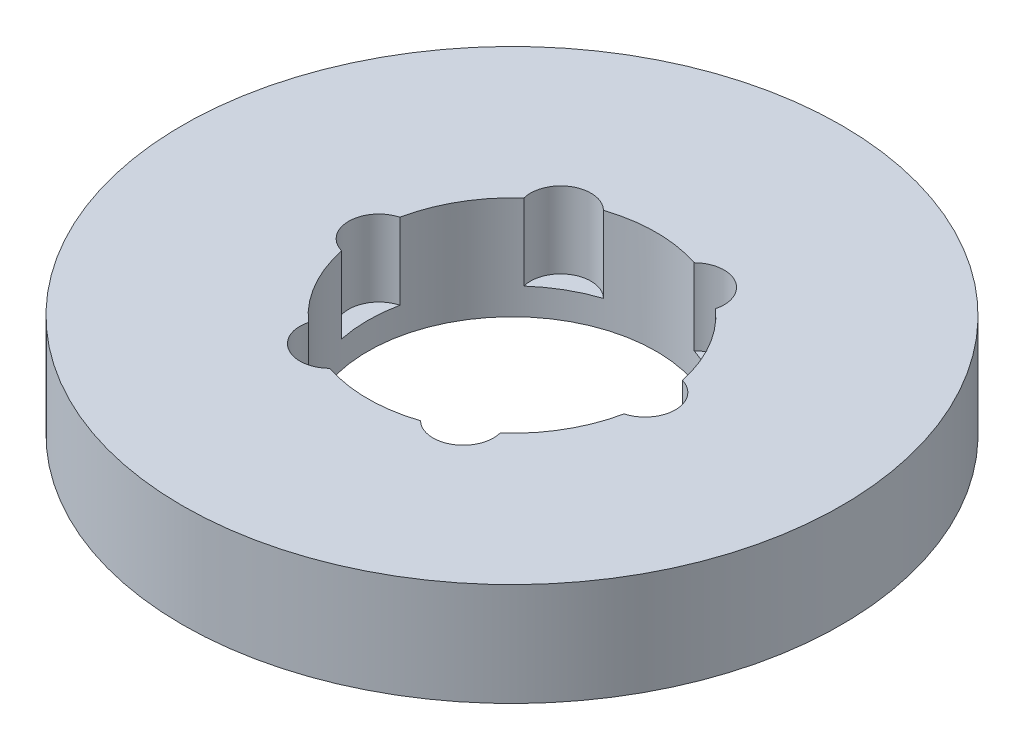
ISO-10303-21;
HEADER;
FILE_DESCRIPTION(('STEP AP214'),'2;1');
FILE_NAME('part.step','',(''),(''),'','','');
FILE_SCHEMA(('AUTOMOTIVE_DESIGN { 1 0 10303 214 1 1 1 1 }'));
ENDSEC;
DATA;
#1=APPLICATION_CONTEXT('core data for automotive mechanical design processes');
#2=APPLICATION_PROTOCOL_DEFINITION('international standard','automotive_design',2000,#1);
#3=PRODUCT_CONTEXT('',#1,'mechanical');
#4=PRODUCT('Part','Part','',(#3));
#5=PRODUCT_RELATED_PRODUCT_CATEGORY('part','',(#4));
#6=PRODUCT_DEFINITION_FORMATION('','',#4);
#7=PRODUCT_DEFINITION_CONTEXT('part definition',#1,'design');
#8=PRODUCT_DEFINITION('design','',#6,#7);
#9=PRODUCT_DEFINITION_SHAPE('','',#8);
#10=(LENGTH_UNIT() NAMED_UNIT(*) SI_UNIT(.MILLI.,.METRE.));
#11=(NAMED_UNIT(*) PLANE_ANGLE_UNIT() SI_UNIT($,.RADIAN.));
#12=(NAMED_UNIT(*) SI_UNIT($,.STERADIAN.) SOLID_ANGLE_UNIT());
#13=UNCERTAINTY_MEASURE_WITH_UNIT(LENGTH_MEASURE(1.E-05),#10,'distance_accuracy_value','');
#14=(GEOMETRIC_REPRESENTATION_CONTEXT(3) GLOBAL_UNCERTAINTY_ASSIGNED_CONTEXT((#13)) GLOBAL_UNIT_ASSIGNED_CONTEXT((#10,
#11,#12)) REPRESENTATION_CONTEXT('',''));
#15=CARTESIAN_POINT('',(0.,0.,0.));
#16=DIRECTION('',(0.,0.,1.));
#17=DIRECTION('',(1.,0.,0.));
#18=AXIS2_PLACEMENT_3D('',#15,#16,#17);
#19=CARTESIAN_POINT('',(0.,25.,0.));
#20=DIRECTION('',(0.,-1.,0.));
#21=DIRECTION('',(0.,0.,-1.));
#22=AXIS2_PLACEMENT_3D('',#19,#20,#21);
#23=CYLINDRICAL_SURFACE('',#22,80.);
#24=CARTESIAN_POINT('',(0.,25.,0.));
#25=DIRECTION('',(0.,1.,0.));
#26=DIRECTION('',(0.,0.,1.));
#27=AXIS2_PLACEMENT_3D('',#24,#25,#26);
#28=CIRCLE('',#27,80.);
#29=CARTESIAN_POINT('',(0.,25.,80.));
#30=VERTEX_POINT('',#29);
#31=EDGE_CURVE('E162',#30,#30,#28,.T.);
#32=ORIENTED_EDGE('',*,*,#31,.F.);
#33=EDGE_LOOP('',(#32));
#34=FACE_BOUND('',#33,.T.);
#35=CARTESIAN_POINT('',(0.,0.,0.));
#36=DIRECTION('',(0.,1.,0.));
#37=DIRECTION('',(0.,0.,1.));
#38=AXIS2_PLACEMENT_3D('',#35,#36,#37);
#39=CIRCLE('',#38,80.);
#40=CARTESIAN_POINT('',(0.,0.,80.));
#41=VERTEX_POINT('',#40);
#42=EDGE_CURVE('E157',#41,#41,#39,.T.);
#43=ORIENTED_EDGE('',*,*,#42,.T.);
#44=EDGE_LOOP('',(#43));
#45=FACE_BOUND('',#44,.T.);
#46=ADVANCED_FACE('F39',(#34,#45),#23,.T.);
#47=CARTESIAN_POINT('',(0.,25.,0.));
#48=DIRECTION('',(0.,1.,0.));
#49=DIRECTION('',(0.,0.,1.));
#50=AXIS2_PLACEMENT_3D('',#47,#48,#49);
#51=PLANE('',#50);
#52=CARTESIAN_POINT('',(-16.156920130633,25.,-27.984606560088));
#53=DIRECTION('',(0.,1.,0.));
#54=DIRECTION('',(-0.866025403784433,0.,0.50000000000001));
#55=AXIS2_PLACEMENT_3D('',#52,#53,#54);
#56=CIRCLE('',#55,7.34113736817755);
#57=CARTESIAN_POINT('',(-11.0129916092175,25.,-33.2221916166785));
#58=VERTEX_POINT('',#57);
#59=CARTESIAN_POINT('',(-23.2647661048299,25.,-26.1486263135859));
#60=VERTEX_POINT('',#59);
#61=EDGE_CURVE('E218',#58,#60,#56,.T.);
#62=ORIENTED_EDGE('',*,*,#61,.F.);
#63=CARTESIAN_POINT('',(0.,25.,0.));
#64=DIRECTION('',(0.,1.,0.));
#65=DIRECTION('',(0.,0.,1.));
#66=AXIS2_PLACEMENT_3D('',#63,#64,#65);
#67=CIRCLE('',#66,35.);
#68=CARTESIAN_POINT('',(11.0129916092168,25.,-33.2221916166788));
#69=VERTEX_POINT('',#68);
#70=EDGE_CURVE('E169',#69,#58,#67,.T.);
#71=ORIENTED_EDGE('',*,*,#70,.F.);
#72=CARTESIAN_POINT('',(16.1569201306324,25.,-27.9846065600884));
#73=DIRECTION('',(0.,1.,0.));
#74=DIRECTION('',(-0.866025403784443,0.,-0.499999999999992));
#75=AXIS2_PLACEMENT_3D('',#72,#73,#74);
#76=CIRCLE('',#75,7.34113736817755);
#77=CARTESIAN_POINT('',(23.2647661048294,25.,-26.1486263135864));
#78=VERTEX_POINT('',#77);
#79=EDGE_CURVE('E285',#78,#69,#76,.T.);
#80=ORIENTED_EDGE('',*,*,#79,.F.);
#81=CARTESIAN_POINT('',(34.2777577140467,25.,-7.07356530309248));
#82=VERTEX_POINT('',#81);
#83=EDGE_CURVE('E174',#82,#78,#67,.T.);
#84=ORIENTED_EDGE('',*,*,#83,.F.);
#85=CARTESIAN_POINT('',(32.3138402612654,25.,0.));
#86=DIRECTION('',(0.,1.,0.));
#87=DIRECTION('',(0.,0.,-1.));
#88=AXIS2_PLACEMENT_3D('',#85,#86,#87);
#89=CIRCLE('',#88,7.34113736817755);
#90=CARTESIAN_POINT('',(34.2777577140467,25.,7.07356530309248));
#91=VERTEX_POINT('',#90);
#92=EDGE_CURVE('E280',#91,#82,#89,.T.);
#93=ORIENTED_EDGE('',*,*,#92,.F.);
#94=CARTESIAN_POINT('',(23.2647661048297,25.,26.1486263135861));
#95=VERTEX_POINT('',#94);
#96=EDGE_CURVE('E164',#95,#91,#67,.T.);
#97=ORIENTED_EDGE('',*,*,#96,.F.);
#98=CARTESIAN_POINT('',(16.1569201306328,25.,27.9846065600881));
#99=DIRECTION('',(0.,1.,0.));
#100=DIRECTION('',(0.866025403784436,0.,-0.500000000000004));
#101=AXIS2_PLACEMENT_3D('',#98,#99,#100);
#102=CIRCLE('',#101,7.34113736817755);
#103=CARTESIAN_POINT('',(11.0129916092172,25.,33.2221916166786));
#104=VERTEX_POINT('',#103);
#105=EDGE_CURVE('E269',#104,#95,#102,.T.);
#106=ORIENTED_EDGE('',*,*,#105,.F.);
#107=CARTESIAN_POINT('',(-11.012991609217,25.,33.2221916166787));
#108=VERTEX_POINT('',#107);
#109=EDGE_CURVE('E149',#108,#104,#67,.T.);
#110=ORIENTED_EDGE('',*,*,#109,.F.);
#111=CARTESIAN_POINT('',(-16.1569201306326,25.,27.9846065600883));
#112=DIRECTION('',(0.,1.,0.));
#113=DIRECTION('',(0.86602540378444,0.,0.499999999999998));
#114=AXIS2_PLACEMENT_3D('',#111,#112,#113);
#115=CIRCLE('',#114,7.34113736817755);
#116=CARTESIAN_POINT('',(-23.2647661048295,25.,26.1486263135863));
#117=VERTEX_POINT('',#116);
#118=EDGE_CURVE('E128',#117,#108,#115,.T.);
#119=ORIENTED_EDGE('',*,*,#118,.F.);
#120=CARTESIAN_POINT('',(-34.2777577140467,25.,7.07356530309248));
#121=VERTEX_POINT('',#120);
#122=EDGE_CURVE('E148',#121,#117,#67,.T.);
#123=ORIENTED_EDGE('',*,*,#122,.F.);
#124=CARTESIAN_POINT('',(-32.3138402612654,25.,0.));
#125=DIRECTION('',(0.,1.,0.));
#126=DIRECTION('',(0.,0.,1.));
#127=AXIS2_PLACEMENT_3D('',#124,#125,#126);
#128=CIRCLE('',#127,7.34113736817755);
#129=CARTESIAN_POINT('',(-34.2777577140467,25.,-7.07356530309248));
#130=VERTEX_POINT('',#129);
#131=EDGE_CURVE('E179',#130,#121,#128,.T.);
#132=ORIENTED_EDGE('',*,*,#131,.F.);
#133=EDGE_CURVE('E161',#60,#130,#67,.T.);
#134=ORIENTED_EDGE('',*,*,#133,.F.);
#135=EDGE_LOOP('',(#62,#71,#80,#84,#93,#97,#106,#110,#119,#123,#132,#134));
#136=FACE_BOUND('',#135,.T.);
#137=ORIENTED_EDGE('',*,*,#31,.T.);
#138=EDGE_LOOP('',(#137));
#139=FACE_BOUND('',#138,.T.);
#140=ADVANCED_FACE('F141',(#136,#139),#51,.T.);
#141=CARTESIAN_POINT('',(0.,0.,0.));
#142=DIRECTION('',(0.,1.,0.));
#143=DIRECTION('',(0.,0.,1.));
#144=AXIS2_PLACEMENT_3D('',#141,#142,#143);
#145=PLANE('',#144);
#146=CARTESIAN_POINT('',(0.,0.,0.));
#147=DIRECTION('',(0.,1.,0.));
#148=DIRECTION('',(0.,0.,1.));
#149=AXIS2_PLACEMENT_3D('',#146,#147,#148);
#150=CIRCLE('',#149,35.);
#151=CARTESIAN_POINT('',(0.,0.,35.));
#152=VERTEX_POINT('',#151);
#153=EDGE_CURVE('E166',#152,#152,#150,.T.);
#154=ORIENTED_EDGE('',*,*,#153,.T.);
#155=EDGE_LOOP('',(#154));
#156=FACE_BOUND('',#155,.T.);
#157=ORIENTED_EDGE('',*,*,#42,.F.);
#158=EDGE_LOOP('',(#157));
#159=FACE_BOUND('',#158,.T.);
#160=ADVANCED_FACE('F234',(#156,#159),#145,.F.);
#161=CARTESIAN_POINT('',(0.,25.,0.));
#162=DIRECTION('',(0.,-1.,0.));
#163=DIRECTION('',(0.,0.,-1.));
#164=AXIS2_PLACEMENT_3D('',#161,#162,#163);
#165=CYLINDRICAL_SURFACE('',#164,35.);
#166=DIRECTION('',(0.,1.,0.));
#167=VECTOR('',#166,1.);
#168=CARTESIAN_POINT('',(-11.0129916092175,15.7467491330755,-33.2221916166786));
#169=LINE('',#168,#167);
#170=CARTESIAN_POINT('',(-11.0129916092175,6.49349826615095,-33.2221916166785));
#171=VERTEX_POINT('',#170);
#172=EDGE_CURVE('E11',#171,#58,#169,.T.);
#173=ORIENTED_EDGE('',*,*,#172,.F.);
#174=CARTESIAN_POINT('',(0.,6.49349826615095,0.));
#175=DIRECTION('',(0.,1.,0.));
#176=DIRECTION('',(0.,0.,1.));
#177=AXIS2_PLACEMENT_3D('',#174,#175,#176);
#178=CIRCLE('',#177,35.);
#179=CARTESIAN_POINT('',(-23.2647661048299,6.49349826615095,-26.1486263135859));
#180=VERTEX_POINT('',#179);
#181=EDGE_CURVE('E214',#171,#180,#178,.T.);
#182=ORIENTED_EDGE('',*,*,#181,.T.);
#183=DIRECTION('',(0.,1.,0.));
#184=VECTOR('',#183,1.);
#185=CARTESIAN_POINT('',(-23.2647661048299,15.7467491330755,-26.1486263135859));
#186=LINE('',#185,#184);
#187=EDGE_CURVE('E46',#60,#180,#186,.F.);
#188=ORIENTED_EDGE('',*,*,#187,.F.);
#189=ORIENTED_EDGE('',*,*,#133,.T.);
#190=DIRECTION('',(0.,1.,0.));
#191=VECTOR('',#190,1.);
#192=CARTESIAN_POINT('',(-34.2777577140467,15.7467491330755,-7.07356530309247));
#193=LINE('',#192,#191);
#194=CARTESIAN_POINT('',(-34.2777577140467,6.49349826615095,-7.07356530309248));
#195=VERTEX_POINT('',#194);
#196=EDGE_CURVE('E187',#195,#130,#193,.T.);
#197=ORIENTED_EDGE('',*,*,#196,.F.);
#198=CARTESIAN_POINT('',(0.,6.49349826615095,0.));
#199=DIRECTION('',(0.,1.,0.));
#200=DIRECTION('',(0.,0.,1.));
#201=AXIS2_PLACEMENT_3D('',#198,#199,#200);
#202=CIRCLE('',#201,35.);
#203=CARTESIAN_POINT('',(-34.2777577140467,6.49349826615095,7.07356530309248));
#204=VERTEX_POINT('',#203);
#205=EDGE_CURVE('E184',#195,#204,#202,.T.);
#206=ORIENTED_EDGE('',*,*,#205,.T.);
#207=DIRECTION('',(0.,1.,0.));
#208=VECTOR('',#207,1.);
#209=CARTESIAN_POINT('',(-34.2777577140467,15.7467491330755,7.07356530309247));
#210=LINE('',#209,#208);
#211=EDGE_CURVE('E158',#121,#204,#210,.F.);
#212=ORIENTED_EDGE('',*,*,#211,.F.);
#213=ORIENTED_EDGE('',*,*,#122,.T.);
#214=DIRECTION('',(0.,1.,0.));
#215=VECTOR('',#214,1.);
#216=CARTESIAN_POINT('',(-23.2647661048295,15.7467491330755,26.1486263135863));
#217=LINE('',#216,#215);
#218=CARTESIAN_POINT('',(-23.2647661048295,6.49349826615095,26.1486263135863));
#219=VERTEX_POINT('',#218);
#220=EDGE_CURVE('E127',#219,#117,#217,.T.);
#221=ORIENTED_EDGE('',*,*,#220,.F.);
#222=CARTESIAN_POINT('',(0.,6.49349826615095,0.));
#223=DIRECTION('',(0.,1.,0.));
#224=DIRECTION('',(0.,0.,1.));
#225=AXIS2_PLACEMENT_3D('',#222,#223,#224);
#226=CIRCLE('',#225,35.);
#227=CARTESIAN_POINT('',(-11.012991609217,6.49349826615095,33.2221916166787));
#228=VERTEX_POINT('',#227);
#229=EDGE_CURVE('E189',#219,#228,#226,.T.);
#230=ORIENTED_EDGE('',*,*,#229,.T.);
#231=DIRECTION('',(0.,1.,0.));
#232=VECTOR('',#231,1.);
#233=CARTESIAN_POINT('',(-11.012991609217,15.7467491330755,33.2221916166787));
#234=LINE('',#233,#232);
#235=EDGE_CURVE('E140',#108,#228,#234,.F.);
#236=ORIENTED_EDGE('',*,*,#235,.F.);
#237=ORIENTED_EDGE('',*,*,#109,.T.);
#238=DIRECTION('',(0.,1.,0.));
#239=VECTOR('',#238,1.);
#240=CARTESIAN_POINT('',(11.0129916092172,15.7467491330755,33.2221916166786));
#241=LINE('',#240,#239);
#242=CARTESIAN_POINT('',(11.0129916092172,6.49349826615095,33.2221916166786));
#243=VERTEX_POINT('',#242);
#244=EDGE_CURVE('E196',#243,#104,#241,.T.);
#245=ORIENTED_EDGE('',*,*,#244,.F.);
#246=CARTESIAN_POINT('',(0.,6.49349826615095,0.));
#247=DIRECTION('',(0.,1.,0.));
#248=DIRECTION('',(0.,0.,1.));
#249=AXIS2_PLACEMENT_3D('',#246,#247,#248);
#250=CIRCLE('',#249,35.);
#251=CARTESIAN_POINT('',(23.2647661048297,6.49349826615095,26.1486263135861));
#252=VERTEX_POINT('',#251);
#253=EDGE_CURVE('E136',#243,#252,#250,.T.);
#254=ORIENTED_EDGE('',*,*,#253,.T.);
#255=DIRECTION('',(0.,1.,0.));
#256=VECTOR('',#255,1.);
#257=CARTESIAN_POINT('',(23.2647661048297,15.7467491330755,26.1486263135861));
#258=LINE('',#257,#256);
#259=EDGE_CURVE('E194',#95,#252,#258,.F.);
#260=ORIENTED_EDGE('',*,*,#259,.F.);
#261=ORIENTED_EDGE('',*,*,#96,.T.);
#262=DIRECTION('',(0.,1.,0.));
#263=VECTOR('',#262,1.);
#264=CARTESIAN_POINT('',(34.2777577140467,15.7467491330755,7.07356530309247));
#265=LINE('',#264,#263);
#266=CARTESIAN_POINT('',(34.2777577140467,6.49349826615095,7.07356530309248));
#267=VERTEX_POINT('',#266);
#268=EDGE_CURVE('E206',#267,#91,#265,.T.);
#269=ORIENTED_EDGE('',*,*,#268,.F.);
#270=CARTESIAN_POINT('',(0.,6.49349826615095,0.));
#271=DIRECTION('',(0.,1.,0.));
#272=DIRECTION('',(0.,0.,1.));
#273=AXIS2_PLACEMENT_3D('',#270,#271,#272);
#274=CIRCLE('',#273,35.);
#275=CARTESIAN_POINT('',(34.2777577140467,6.49349826615095,-7.07356530309248));
#276=VERTEX_POINT('',#275);
#277=EDGE_CURVE('E199',#267,#276,#274,.T.);
#278=ORIENTED_EDGE('',*,*,#277,.T.);
#279=DIRECTION('',(0.,1.,0.));
#280=VECTOR('',#279,1.);
#281=CARTESIAN_POINT('',(34.2777577140467,15.7467491330755,-7.07356530309247));
#282=LINE('',#281,#280);
#283=EDGE_CURVE('E201',#82,#276,#282,.F.);
#284=ORIENTED_EDGE('',*,*,#283,.F.);
#285=ORIENTED_EDGE('',*,*,#83,.T.);
#286=DIRECTION('',(0.,1.,0.));
#287=VECTOR('',#286,1.);
#288=CARTESIAN_POINT('',(23.2647661048294,15.7467491330755,-26.1486263135864));
#289=LINE('',#288,#287);
#290=CARTESIAN_POINT('',(23.2647661048294,6.49349826615095,-26.1486263135864));
#291=VERTEX_POINT('',#290);
#292=EDGE_CURVE('E213',#291,#78,#289,.T.);
#293=ORIENTED_EDGE('',*,*,#292,.F.);
#294=CARTESIAN_POINT('',(0.,6.49349826615095,0.));
#295=DIRECTION('',(0.,1.,0.));
#296=DIRECTION('',(0.,0.,1.));
#297=AXIS2_PLACEMENT_3D('',#294,#295,#296);
#298=CIRCLE('',#297,35.);
#299=CARTESIAN_POINT('',(11.0129916092168,6.49349826615095,-33.2221916166788));
#300=VERTEX_POINT('',#299);
#301=EDGE_CURVE('E208',#291,#300,#298,.T.);
#302=ORIENTED_EDGE('',*,*,#301,.T.);
#303=DIRECTION('',(0.,1.,0.));
#304=VECTOR('',#303,1.);
#305=CARTESIAN_POINT('',(11.0129916092168,15.7467491330755,-33.2221916166788));
#306=LINE('',#305,#304);
#307=EDGE_CURVE('E211',#69,#300,#306,.F.);
#308=ORIENTED_EDGE('',*,*,#307,.F.);
#309=ORIENTED_EDGE('',*,*,#70,.T.);
#310=EDGE_LOOP('',(#173,#182,#188,#189,#197,#206,#212,#213,#221,#230,#236,#237,#245,#254,#260,
#261,#269,#278,#284,#285,#293,#302,#308,#309));
#311=FACE_BOUND('',#310,.T.);
#312=ORIENTED_EDGE('',*,*,#153,.F.);
#313=EDGE_LOOP('',(#312));
#314=FACE_BOUND('',#313,.T.);
#315=ADVANCED_FACE('F152',(#311,#314),#165,.F.);
#316=CARTESIAN_POINT('',(-32.3138402612654,6.49349826615095,0.));
#317=DIRECTION('',(0.,1.,0.));
#318=DIRECTION('',(0.,0.,1.));
#319=AXIS2_PLACEMENT_3D('',#316,#317,#318);
#320=CYLINDRICAL_SURFACE('',#319,7.34113736817755);
#321=ORIENTED_EDGE('',*,*,#196,.T.);
#322=ORIENTED_EDGE('',*,*,#131,.T.);
#323=ORIENTED_EDGE('',*,*,#211,.T.);
#324=CARTESIAN_POINT('',(-32.3138402612654,6.49349826615095,0.));
#325=DIRECTION('',(0.,1.,0.));
#326=DIRECTION('',(0.,0.,1.));
#327=AXIS2_PLACEMENT_3D('',#324,#325,#326);
#328=CIRCLE('',#327,7.34113736817755);
#329=EDGE_CURVE('E180',#195,#204,#328,.T.);
#330=ORIENTED_EDGE('',*,*,#329,.F.);
#331=EDGE_LOOP('',(#321,#322,#323,#330));
#332=FACE_BOUND('',#331,.T.);
#333=ADVANCED_FACE('F244',(#332),#320,.F.);
#334=CARTESIAN_POINT('',(-32.3138402612654,6.49349826615095,0.));
#335=DIRECTION('',(0.,1.,0.));
#336=DIRECTION('',(0.,0.,1.));
#337=AXIS2_PLACEMENT_3D('',#334,#335,#336);
#338=PLANE('',#337);
#339=ORIENTED_EDGE('',*,*,#329,.T.);
#340=ORIENTED_EDGE('',*,*,#205,.F.);
#341=EDGE_LOOP('',(#339,#340));
#342=FACE_BOUND('',#341,.T.);
#343=ADVANCED_FACE('F248',(#342),#338,.T.);
#344=CARTESIAN_POINT('',(-16.1569201306326,6.49349826615095,27.9846065600883));
#345=DIRECTION('',(0.,1.,0.));
#346=DIRECTION('',(0.,0.,1.));
#347=AXIS2_PLACEMENT_3D('',#344,#345,#346);
#348=CYLINDRICAL_SURFACE('',#347,7.34113736817755);
#349=ORIENTED_EDGE('',*,*,#220,.T.);
#350=ORIENTED_EDGE('',*,*,#118,.T.);
#351=ORIENTED_EDGE('',*,*,#235,.T.);
#352=CARTESIAN_POINT('',(-16.1569201306326,6.49349826615095,27.9846065600883));
#353=DIRECTION('',(0.,1.,0.));
#354=DIRECTION('',(0.86602540378444,0.,0.499999999999998));
#355=AXIS2_PLACEMENT_3D('',#352,#353,#354);
#356=CIRCLE('',#355,7.34113736817755);
#357=EDGE_CURVE('E135',#219,#228,#356,.T.);
#358=ORIENTED_EDGE('',*,*,#357,.F.);
#359=EDGE_LOOP('',(#349,#350,#351,#358));
#360=FACE_BOUND('',#359,.T.);
#361=ADVANCED_FACE('F126',(#360),#348,.F.);
#362=CARTESIAN_POINT('',(-16.1569201306326,6.49349826615095,27.9846065600883));
#363=DIRECTION('',(0.,1.,0.));
#364=DIRECTION('',(0.86602540378444,0.,0.499999999999998));
#365=AXIS2_PLACEMENT_3D('',#362,#363,#364);
#366=PLANE('',#365);
#367=ORIENTED_EDGE('',*,*,#357,.T.);
#368=ORIENTED_EDGE('',*,*,#229,.F.);
#369=EDGE_LOOP('',(#367,#368));
#370=FACE_BOUND('',#369,.T.);
#371=ADVANCED_FACE('F258',(#370),#366,.T.);
#372=CARTESIAN_POINT('',(16.1569201306328,6.49349826615095,27.9846065600881));
#373=DIRECTION('',(0.,1.,0.));
#374=DIRECTION('',(0.,0.,1.));
#375=AXIS2_PLACEMENT_3D('',#372,#373,#374);
#376=CYLINDRICAL_SURFACE('',#375,7.34113736817755);
#377=ORIENTED_EDGE('',*,*,#244,.T.);
#378=ORIENTED_EDGE('',*,*,#105,.T.);
#379=ORIENTED_EDGE('',*,*,#259,.T.);
#380=CARTESIAN_POINT('',(16.1569201306328,6.49349826615095,27.9846065600881));
#381=DIRECTION('',(0.,1.,0.));
#382=DIRECTION('',(0.866025403784436,0.,-0.500000000000004));
#383=AXIS2_PLACEMENT_3D('',#380,#381,#382);
#384=CIRCLE('',#383,7.34113736817755);
#385=EDGE_CURVE('E147',#243,#252,#384,.T.);
#386=ORIENTED_EDGE('',*,*,#385,.F.);
#387=EDGE_LOOP('',(#377,#378,#379,#386));
#388=FACE_BOUND('',#387,.T.);
#389=ADVANCED_FACE('F256',(#388),#376,.F.);
#390=CARTESIAN_POINT('',(16.1569201306328,6.49349826615095,27.9846065600881));
#391=DIRECTION('',(0.,1.,0.));
#392=DIRECTION('',(0.866025403784436,0.,-0.500000000000004));
#393=AXIS2_PLACEMENT_3D('',#390,#391,#392);
#394=PLANE('',#393);
#395=ORIENTED_EDGE('',*,*,#385,.T.);
#396=ORIENTED_EDGE('',*,*,#253,.F.);
#397=EDGE_LOOP('',(#395,#396));
#398=FACE_BOUND('',#397,.T.);
#399=ADVANCED_FACE('F263',(#398),#394,.T.);
#400=CARTESIAN_POINT('',(32.3138402612654,6.49349826615095,0.));
#401=DIRECTION('',(0.,1.,0.));
#402=DIRECTION('',(0.,0.,1.));
#403=AXIS2_PLACEMENT_3D('',#400,#401,#402);
#404=CYLINDRICAL_SURFACE('',#403,7.34113736817755);
#405=ORIENTED_EDGE('',*,*,#268,.T.);
#406=ORIENTED_EDGE('',*,*,#92,.T.);
#407=ORIENTED_EDGE('',*,*,#283,.T.);
#408=CARTESIAN_POINT('',(32.3138402612654,6.49349826615095,0.));
#409=DIRECTION('',(0.,1.,0.));
#410=DIRECTION('',(0.,0.,-1.));
#411=AXIS2_PLACEMENT_3D('',#408,#409,#410);
#412=CIRCLE('',#411,7.34113736817755);
#413=EDGE_CURVE('E273',#267,#276,#412,.T.);
#414=ORIENTED_EDGE('',*,*,#413,.F.);
#415=EDGE_LOOP('',(#405,#406,#407,#414));
#416=FACE_BOUND('',#415,.T.);
#417=ADVANCED_FACE('F297',(#416),#404,.F.);
#418=CARTESIAN_POINT('',(32.3138402612654,6.49349826615095,0.));
#419=DIRECTION('',(0.,1.,0.));
#420=DIRECTION('',(0.,0.,-1.));
#421=AXIS2_PLACEMENT_3D('',#418,#419,#420);
#422=PLANE('',#421);
#423=ORIENTED_EDGE('',*,*,#413,.T.);
#424=ORIENTED_EDGE('',*,*,#277,.F.);
#425=EDGE_LOOP('',(#423,#424));
#426=FACE_BOUND('',#425,.T.);
#427=ADVANCED_FACE('F299',(#426),#422,.T.);
#428=CARTESIAN_POINT('',(16.1569201306324,6.49349826615095,-27.9846065600884));
#429=DIRECTION('',(0.,1.,0.));
#430=DIRECTION('',(0.,0.,1.));
#431=AXIS2_PLACEMENT_3D('',#428,#429,#430);
#432=CYLINDRICAL_SURFACE('',#431,7.34113736817755);
#433=ORIENTED_EDGE('',*,*,#292,.T.);
#434=ORIENTED_EDGE('',*,*,#79,.T.);
#435=ORIENTED_EDGE('',*,*,#307,.T.);
#436=CARTESIAN_POINT('',(16.1569201306324,6.49349826615095,-27.9846065600884));
#437=DIRECTION('',(0.,1.,0.));
#438=DIRECTION('',(-0.866025403784443,0.,-0.499999999999992));
#439=AXIS2_PLACEMENT_3D('',#436,#437,#438);
#440=CIRCLE('',#439,7.34113736817755);
#441=EDGE_CURVE('E56',#291,#300,#440,.T.);
#442=ORIENTED_EDGE('',*,*,#441,.F.);
#443=EDGE_LOOP('',(#433,#434,#435,#442));
#444=FACE_BOUND('',#443,.T.);
#445=ADVANCED_FACE('F292',(#444),#432,.F.);
#446=CARTESIAN_POINT('',(16.1569201306324,6.49349826615095,-27.9846065600884));
#447=DIRECTION('',(0.,1.,0.));
#448=DIRECTION('',(-0.866025403784443,0.,-0.499999999999992));
#449=AXIS2_PLACEMENT_3D('',#446,#447,#448);
#450=PLANE('',#449);
#451=ORIENTED_EDGE('',*,*,#441,.T.);
#452=ORIENTED_EDGE('',*,*,#301,.F.);
#453=EDGE_LOOP('',(#451,#452));
#454=FACE_BOUND('',#453,.T.);
#455=ADVANCED_FACE('F226',(#454),#450,.T.);
#456=CARTESIAN_POINT('',(-16.156920130633,6.49349826615095,-27.984606560088));
#457=DIRECTION('',(0.,1.,0.));
#458=DIRECTION('',(0.,0.,1.));
#459=AXIS2_PLACEMENT_3D('',#456,#457,#458);
#460=CYLINDRICAL_SURFACE('',#459,7.34113736817755);
#461=ORIENTED_EDGE('',*,*,#172,.T.);
#462=ORIENTED_EDGE('',*,*,#61,.T.);
#463=ORIENTED_EDGE('',*,*,#187,.T.);
#464=CARTESIAN_POINT('',(-16.156920130633,6.49349826615095,-27.984606560088));
#465=DIRECTION('',(0.,1.,0.));
#466=DIRECTION('',(-0.866025403784433,0.,0.50000000000001));
#467=AXIS2_PLACEMENT_3D('',#464,#465,#466);
#468=CIRCLE('',#467,7.34113736817755);
#469=EDGE_CURVE('E55',#171,#180,#468,.T.);
#470=ORIENTED_EDGE('',*,*,#469,.F.);
#471=EDGE_LOOP('',(#461,#462,#463,#470));
#472=FACE_BOUND('',#471,.T.);
#473=ADVANCED_FACE('F217',(#472),#460,.F.);
#474=CARTESIAN_POINT('',(-16.156920130633,6.49349826615095,-27.984606560088));
#475=DIRECTION('',(0.,1.,0.));
#476=DIRECTION('',(-0.866025403784433,0.,0.50000000000001));
#477=AXIS2_PLACEMENT_3D('',#474,#475,#476);
#478=PLANE('',#477);
#479=ORIENTED_EDGE('',*,*,#469,.T.);
#480=ORIENTED_EDGE('',*,*,#181,.F.);
#481=EDGE_LOOP('',(#479,#480));
#482=FACE_BOUND('',#481,.T.);
#483=ADVANCED_FACE('F219',(#482),#478,.T.);
#484=CLOSED_SHELL('',(#46,#140,#160,#315,#333,#343,#361,#371,#389,#399,#417,#427,#445,#455,#473,#483));
#485=MANIFOLD_SOLID_BREP('B2',#484);
#486=ADVANCED_BREP_SHAPE_REPRESENTATION('',(#18,#485),#14);
#487=SHAPE_DEFINITION_REPRESENTATION(#9,#486);
ENDSEC;
END-ISO-10303-21;
